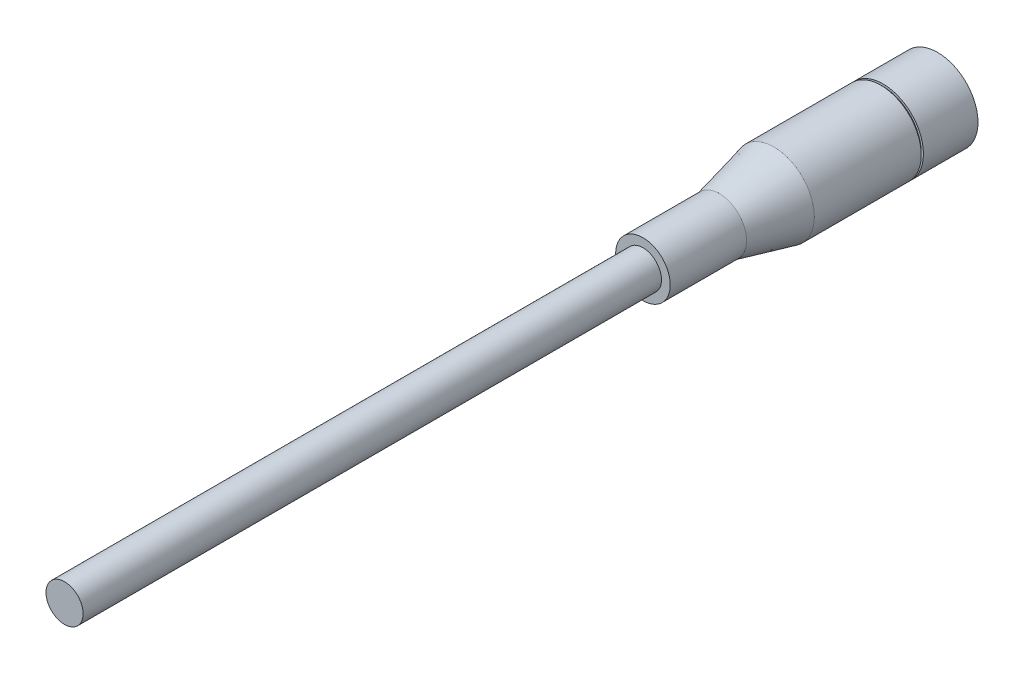
ISO-10303-21;
HEADER;
FILE_DESCRIPTION(('STEP AP214'),'2;1');
FILE_NAME('part.step','',(''),(''),'','','');
FILE_SCHEMA(('AUTOMOTIVE_DESIGN { 1 0 10303 214 1 1 1 1 }'));
ENDSEC;
DATA;
#1=APPLICATION_CONTEXT('core data for automotive mechanical design processes');
#2=APPLICATION_PROTOCOL_DEFINITION('international standard','automotive_design',2000,#1);
#3=PRODUCT_CONTEXT('',#1,'mechanical');
#4=PRODUCT('Part','Part','',(#3));
#5=PRODUCT_RELATED_PRODUCT_CATEGORY('part','',(#4));
#6=PRODUCT_DEFINITION_FORMATION('','',#4);
#7=PRODUCT_DEFINITION_CONTEXT('part definition',#1,'design');
#8=PRODUCT_DEFINITION('design','',#6,#7);
#9=PRODUCT_DEFINITION_SHAPE('','',#8);
#10=(LENGTH_UNIT() NAMED_UNIT(*) SI_UNIT(.MILLI.,.METRE.));
#11=(NAMED_UNIT(*) PLANE_ANGLE_UNIT() SI_UNIT($,.RADIAN.));
#12=(NAMED_UNIT(*) SI_UNIT($,.STERADIAN.) SOLID_ANGLE_UNIT());
#13=UNCERTAINTY_MEASURE_WITH_UNIT(LENGTH_MEASURE(1.E-05),#10,'distance_accuracy_value','');
#14=(GEOMETRIC_REPRESENTATION_CONTEXT(3) GLOBAL_UNCERTAINTY_ASSIGNED_CONTEXT((#13)) GLOBAL_UNIT_ASSIGNED_CONTEXT((#10,
#11,#12)) REPRESENTATION_CONTEXT('',''));
#15=CARTESIAN_POINT('',(0.,0.,0.));
#16=DIRECTION('',(0.,0.,1.));
#17=DIRECTION('',(1.,0.,0.));
#18=AXIS2_PLACEMENT_3D('',#15,#16,#17);
#19=CARTESIAN_POINT('',(0.,0.,0.));
#20=DIRECTION('',(0.,0.,1.));
#21=DIRECTION('',(1.,0.,0.));
#22=AXIS2_PLACEMENT_3D('',#19,#20,#21);
#23=PLANE('',#22);
#24=CARTESIAN_POINT('',(0.,0.,0.));
#25=DIRECTION('',(0.,0.,-1.));
#26=DIRECTION('',(-1.,0.,0.));
#27=AXIS2_PLACEMENT_3D('',#24,#25,#26);
#28=CIRCLE('',#27,3.937);
#29=CARTESIAN_POINT('',(-3.937,0.,0.));
#30=VERTEX_POINT('',#29);
#31=EDGE_CURVE('E84',#30,#30,#28,.T.);
#32=ORIENTED_EDGE('',*,*,#31,.F.);
#33=EDGE_LOOP('',(#32));
#34=FACE_BOUND('',#33,.T.);
#35=CARTESIAN_POINT('',(0.,0.,0.));
#36=DIRECTION('',(0.,0.,1.));
#37=DIRECTION('',(1.,0.,0.));
#38=AXIS2_PLACEMENT_3D('',#35,#36,#37);
#39=CIRCLE('',#38,4.699);
#40=CARTESIAN_POINT('',(4.699,0.,0.));
#41=VERTEX_POINT('',#40);
#42=EDGE_CURVE('E11',#41,#41,#39,.T.);
#43=ORIENTED_EDGE('',*,*,#42,.F.);
#44=EDGE_LOOP('',(#43));
#45=FACE_BOUND('',#44,.T.);
#46=ADVANCED_FACE('F49',(#34,#45),#23,.F.);
#47=CARTESIAN_POINT('',(0.,0.,36.0045));
#48=DIRECTION('',(0.,0.,1.));
#49=DIRECTION('',(1.,0.,0.));
#50=AXIS2_PLACEMENT_3D('',#47,#48,#49);
#51=CYLINDRICAL_SURFACE('',#50,4.699);
#52=CARTESIAN_POINT('',(0.,0.,6.35));
#53=DIRECTION('',(0.,0.,1.));
#54=DIRECTION('',(1.,0.,0.));
#55=AXIS2_PLACEMENT_3D('',#52,#53,#54);
#56=CIRCLE('',#55,4.699);
#57=CARTESIAN_POINT('',(4.699,0.,6.35));
#58=VERTEX_POINT('',#57);
#59=EDGE_CURVE('E56',#58,#58,#56,.T.);
#60=ORIENTED_EDGE('',*,*,#59,.F.);
#61=EDGE_LOOP('',(#60));
#62=FACE_BOUND('',#61,.T.);
#63=ORIENTED_EDGE('',*,*,#42,.T.);
#64=EDGE_LOOP('',(#63));
#65=FACE_BOUND('',#64,.T.);
#66=ADVANCED_FACE('F150',(#62,#65),#51,.T.);
#67=CARTESIAN_POINT('',(0.,4.699,6.35));
#68=DIRECTION('',(0.,0.,-1.));
#69=DIRECTION('',(-1.,0.,0.));
#70=AXIS2_PLACEMENT_3D('',#67,#68,#69);
#71=PLANE('',#70);
#72=CARTESIAN_POINT('',(0.,0.,6.35));
#73=DIRECTION('',(0.,0.,1.));
#74=DIRECTION('',(1.,0.,0.));
#75=AXIS2_PLACEMENT_3D('',#72,#73,#74);
#76=CIRCLE('',#75,4.445);
#77=CARTESIAN_POINT('',(4.445,0.,6.35));
#78=VERTEX_POINT('',#77);
#79=EDGE_CURVE('E60',#78,#78,#76,.T.);
#80=ORIENTED_EDGE('',*,*,#79,.F.);
#81=EDGE_LOOP('',(#80));
#82=FACE_BOUND('',#81,.T.);
#83=ORIENTED_EDGE('',*,*,#59,.T.);
#84=EDGE_LOOP('',(#83));
#85=FACE_BOUND('',#84,.T.);
#86=ADVANCED_FACE('F155',(#82,#85),#71,.F.);
#87=CARTESIAN_POINT('',(0.,0.,36.0045));
#88=DIRECTION('',(0.,0.,1.));
#89=DIRECTION('',(1.,0.,0.));
#90=AXIS2_PLACEMENT_3D('',#87,#88,#89);
#91=CYLINDRICAL_SURFACE('',#90,4.445);
#92=CARTESIAN_POINT('',(0.,0.,6.604));
#93=DIRECTION('',(0.,0.,1.));
#94=DIRECTION('',(1.,0.,0.));
#95=AXIS2_PLACEMENT_3D('',#92,#93,#94);
#96=CIRCLE('',#95,4.445);
#97=CARTESIAN_POINT('',(4.445,0.,6.604));
#98=VERTEX_POINT('',#97);
#99=EDGE_CURVE('E65',#98,#98,#96,.T.);
#100=ORIENTED_EDGE('',*,*,#99,.F.);
#101=EDGE_LOOP('',(#100));
#102=FACE_BOUND('',#101,.T.);
#103=ORIENTED_EDGE('',*,*,#79,.T.);
#104=EDGE_LOOP('',(#103));
#105=FACE_BOUND('',#104,.T.);
#106=ADVANCED_FACE('F163',(#102,#105),#91,.T.);
#107=CARTESIAN_POINT('',(0.,4.445,6.604));
#108=DIRECTION('',(0.,0.,1.));
#109=DIRECTION('',(1.,0.,0.));
#110=AXIS2_PLACEMENT_3D('',#107,#108,#109);
#111=PLANE('',#110);
#112=CARTESIAN_POINT('',(0.,0.,6.604));
#113=DIRECTION('',(0.,0.,1.));
#114=DIRECTION('',(1.,0.,0.));
#115=AXIS2_PLACEMENT_3D('',#112,#113,#114);
#116=CIRCLE('',#115,4.699);
#117=CARTESIAN_POINT('',(4.699,0.,6.604));
#118=VERTEX_POINT('',#117);
#119=EDGE_CURVE('E68',#118,#118,#116,.T.);
#120=ORIENTED_EDGE('',*,*,#119,.F.);
#121=EDGE_LOOP('',(#120));
#122=FACE_BOUND('',#121,.T.);
#123=ORIENTED_EDGE('',*,*,#99,.T.);
#124=EDGE_LOOP('',(#123));
#125=FACE_BOUND('',#124,.T.);
#126=ADVANCED_FACE('F170',(#122,#125),#111,.F.);
#127=CARTESIAN_POINT('',(0.,0.,36.0045));
#128=DIRECTION('',(0.,0.,1.));
#129=DIRECTION('',(1.,0.,0.));
#130=AXIS2_PLACEMENT_3D('',#127,#128,#129);
#131=CYLINDRICAL_SURFACE('',#130,4.699);
#132=CARTESIAN_POINT('',(0.,0.,19.05));
#133=DIRECTION('',(0.,0.,1.));
#134=DIRECTION('',(1.,0.,0.));
#135=AXIS2_PLACEMENT_3D('',#132,#133,#134);
#136=CIRCLE('',#135,4.699);
#137=CARTESIAN_POINT('',(4.699,0.,19.05));
#138=VERTEX_POINT('',#137);
#139=EDGE_CURVE('E71',#138,#138,#136,.T.);
#140=ORIENTED_EDGE('',*,*,#139,.F.);
#141=EDGE_LOOP('',(#140));
#142=FACE_BOUND('',#141,.T.);
#143=ORIENTED_EDGE('',*,*,#119,.T.);
#144=EDGE_LOOP('',(#143));
#145=FACE_BOUND('',#144,.T.);
#146=ADVANCED_FACE('F174',(#142,#145),#131,.T.);
#147=CARTESIAN_POINT('',(0.,0.,19.05));
#148=DIRECTION('',(0.,0.,-1.));
#149=DIRECTION('',(-1.,0.,0.));
#150=AXIS2_PLACEMENT_3D('',#147,#148,#149);
#151=CONICAL_SURFACE('',#150,4.699,0.235544980720863);
#152=CARTESIAN_POINT('',(0.,0.,25.4));
#153=DIRECTION('',(0.,0.,1.));
#154=DIRECTION('',(1.,0.,0.));
#155=AXIS2_PLACEMENT_3D('',#152,#153,#154);
#156=CIRCLE('',#155,3.175);
#157=CARTESIAN_POINT('',(3.175,0.,25.4));
#158=VERTEX_POINT('',#157);
#159=EDGE_CURVE('E74',#158,#158,#156,.T.);
#160=ORIENTED_EDGE('',*,*,#159,.F.);
#161=EDGE_LOOP('',(#160));
#162=FACE_BOUND('',#161,.T.);
#163=ORIENTED_EDGE('',*,*,#139,.T.);
#164=EDGE_LOOP('',(#163));
#165=FACE_BOUND('',#164,.T.);
#166=ADVANCED_FACE('F178',(#162,#165),#151,.T.);
#167=CARTESIAN_POINT('',(0.,0.,36.0045));
#168=DIRECTION('',(0.,0.,1.));
#169=DIRECTION('',(1.,0.,0.));
#170=AXIS2_PLACEMENT_3D('',#167,#168,#169);
#171=CYLINDRICAL_SURFACE('',#170,3.175);
#172=CARTESIAN_POINT('',(0.,0.,34.29));
#173=DIRECTION('',(0.,0.,1.));
#174=DIRECTION('',(1.,0.,0.));
#175=AXIS2_PLACEMENT_3D('',#172,#173,#174);
#176=CIRCLE('',#175,3.175);
#177=CARTESIAN_POINT('',(3.175,0.,34.29));
#178=VERTEX_POINT('',#177);
#179=EDGE_CURVE('E77',#178,#178,#176,.T.);
#180=ORIENTED_EDGE('',*,*,#179,.F.);
#181=EDGE_LOOP('',(#180));
#182=FACE_BOUND('',#181,.T.);
#183=ORIENTED_EDGE('',*,*,#159,.T.);
#184=EDGE_LOOP('',(#183));
#185=FACE_BOUND('',#184,.T.);
#186=ADVANCED_FACE('F182',(#182,#185),#171,.T.);
#187=CARTESIAN_POINT('',(0.,3.175,34.29));
#188=DIRECTION('',(0.,0.,-1.));
#189=DIRECTION('',(-1.,0.,0.));
#190=AXIS2_PLACEMENT_3D('',#187,#188,#189);
#191=PLANE('',#190);
#192=CARTESIAN_POINT('',(0.,0.,34.29));
#193=DIRECTION('',(0.,0.,-1.));
#194=DIRECTION('',(-1.,0.,0.));
#195=AXIS2_PLACEMENT_3D('',#192,#193,#194);
#196=CIRCLE('',#195,2.159);
#197=CARTESIAN_POINT('',(-2.159,0.,34.29));
#198=VERTEX_POINT('',#197);
#199=EDGE_CURVE('E52',#198,#198,#196,.T.);
#200=ORIENTED_EDGE('',*,*,#199,.T.);
#201=EDGE_LOOP('',(#200));
#202=FACE_BOUND('',#201,.T.);
#203=ORIENTED_EDGE('',*,*,#179,.T.);
#204=EDGE_LOOP('',(#203));
#205=FACE_BOUND('',#204,.T.);
#206=ADVANCED_FACE('F186',(#202,#205),#191,.F.);
#207=CARTESIAN_POINT('',(0.,0.,101.6));
#208=DIRECTION('',(0.,0.,-1.));
#209=DIRECTION('',(-1.,0.,0.));
#210=AXIS2_PLACEMENT_3D('',#207,#208,#209);
#211=CYLINDRICAL_SURFACE('',#210,2.159);
#212=CARTESIAN_POINT('',(0.,0.,101.6));
#213=DIRECTION('',(0.,0.,-1.));
#214=DIRECTION('',(-1.,0.,0.));
#215=AXIS2_PLACEMENT_3D('',#212,#213,#214);
#216=CIRCLE('',#215,2.159);
#217=CARTESIAN_POINT('',(-2.159,0.,101.6));
#218=VERTEX_POINT('',#217);
#219=EDGE_CURVE('E80',#218,#218,#216,.T.);
#220=ORIENTED_EDGE('',*,*,#219,.T.);
#221=EDGE_LOOP('',(#220));
#222=FACE_BOUND('',#221,.T.);
#223=ORIENTED_EDGE('',*,*,#199,.F.);
#224=EDGE_LOOP('',(#223));
#225=FACE_BOUND('',#224,.T.);
#226=ADVANCED_FACE('F146',(#222,#225),#211,.T.);
#227=CARTESIAN_POINT('',(0.,0.,101.6));
#228=DIRECTION('',(0.,0.,-1.));
#229=DIRECTION('',(-1.,0.,0.));
#230=AXIS2_PLACEMENT_3D('',#227,#228,#229);
#231=PLANE('',#230);
#232=ORIENTED_EDGE('',*,*,#219,.F.);
#233=EDGE_LOOP('',(#232));
#234=FACE_BOUND('',#233,.T.);
#235=ADVANCED_FACE('F137',(#234),#231,.F.);
#236=CARTESIAN_POINT('',(0.,0.,5.08));
#237=DIRECTION('',(0.,0.,-1.));
#238=DIRECTION('',(-1.,0.,0.));
#239=AXIS2_PLACEMENT_3D('',#236,#237,#238);
#240=CYLINDRICAL_SURFACE('',#239,3.175);
#241=CARTESIAN_POINT('',(0.,0.,5.08));
#242=DIRECTION('',(0.,0.,-1.));
#243=DIRECTION('',(-1.,0.,0.));
#244=AXIS2_PLACEMENT_3D('',#241,#242,#243);
#245=CIRCLE('',#244,3.175);
#246=CARTESIAN_POINT('',(-3.175,0.,5.08));
#247=VERTEX_POINT('',#246);
#248=EDGE_CURVE('E87',#247,#247,#245,.T.);
#249=ORIENTED_EDGE('',*,*,#248,.T.);
#250=EDGE_LOOP('',(#249));
#251=FACE_BOUND('',#250,.T.);
#252=CARTESIAN_POINT('',(0.,0.,0.));
#253=DIRECTION('',(0.,0.,-1.));
#254=DIRECTION('',(-1.,0.,0.));
#255=AXIS2_PLACEMENT_3D('',#252,#253,#254);
#256=CIRCLE('',#255,3.175);
#257=CARTESIAN_POINT('',(-3.175,0.,0.));
#258=VERTEX_POINT('',#257);
#259=EDGE_CURVE('E88',#258,#258,#256,.T.);
#260=ORIENTED_EDGE('',*,*,#259,.F.);
#261=EDGE_LOOP('',(#260));
#262=FACE_BOUND('',#261,.T.);
#263=ADVANCED_FACE('F134',(#251,#262),#240,.T.);
#264=CARTESIAN_POINT('',(0.,0.,5.08));
#265=DIRECTION('',(0.,0.,-1.));
#266=DIRECTION('',(-1.,0.,0.));
#267=AXIS2_PLACEMENT_3D('',#264,#265,#266);
#268=CYLINDRICAL_SURFACE('',#267,3.937);
#269=CARTESIAN_POINT('',(0.,0.,5.08));
#270=DIRECTION('',(0.,0.,-1.));
#271=DIRECTION('',(-1.,0.,0.));
#272=AXIS2_PLACEMENT_3D('',#269,#270,#271);
#273=CIRCLE('',#272,3.937);
#274=CARTESIAN_POINT('',(-3.937,0.,5.08));
#275=VERTEX_POINT('',#274);
#276=EDGE_CURVE('E83',#275,#275,#273,.T.);
#277=ORIENTED_EDGE('',*,*,#276,.F.);
#278=EDGE_LOOP('',(#277));
#279=FACE_BOUND('',#278,.T.);
#280=ORIENTED_EDGE('',*,*,#31,.T.);
#281=EDGE_LOOP('',(#280));
#282=FACE_BOUND('',#281,.T.);
#283=ADVANCED_FACE('F136',(#279,#282),#268,.F.);
#284=CARTESIAN_POINT('',(-10.4792213562373,0.,5.08));
#285=DIRECTION('',(0.,0.,-1.));
#286=DIRECTION('',(-1.,0.,0.));
#287=AXIS2_PLACEMENT_3D('',#284,#285,#286);
#288=PLANE('',#287);
#289=ORIENTED_EDGE('',*,*,#248,.F.);
#290=EDGE_LOOP('',(#289));
#291=FACE_BOUND('',#290,.T.);
#292=ORIENTED_EDGE('',*,*,#276,.T.);
#293=EDGE_LOOP('',(#292));
#294=FACE_BOUND('',#293,.T.);
#295=ADVANCED_FACE('F127',(#291,#294),#288,.T.);
#296=CARTESIAN_POINT('',(-2.54,0.,0.));
#297=DIRECTION('',(0.,0.,-1.));
#298=DIRECTION('',(-1.,0.,0.));
#299=AXIS2_PLACEMENT_3D('',#296,#297,#298);
#300=CIRCLE('',#299,0.381);
#301=CARTESIAN_POINT('',(-2.921,0.,0.));
#302=VERTEX_POINT('',#301);
#303=EDGE_CURVE('E108',#302,#302,#300,.T.);
#304=ORIENTED_EDGE('',*,*,#303,.F.);
#305=EDGE_LOOP('',(#304));
#306=FACE_BOUND('',#305,.T.);
#307=CARTESIAN_POINT('',(0.,2.54,0.));
#308=DIRECTION('',(0.,0.,-1.));
#309=DIRECTION('',(-1.,0.,0.));
#310=AXIS2_PLACEMENT_3D('',#307,#308,#309);
#311=CIRCLE('',#310,0.381);
#312=CARTESIAN_POINT('',(-0.381,2.54,0.));
#313=VERTEX_POINT('',#312);
#314=EDGE_CURVE('E102',#313,#313,#311,.T.);
#315=ORIENTED_EDGE('',*,*,#314,.F.);
#316=EDGE_LOOP('',(#315));
#317=FACE_BOUND('',#316,.T.);
#318=CARTESIAN_POINT('',(2.54,0.,0.));
#319=DIRECTION('',(0.,0.,-1.));
#320=DIRECTION('',(-1.,0.,0.));
#321=AXIS2_PLACEMENT_3D('',#318,#319,#320);
#322=CIRCLE('',#321,0.381);
#323=CARTESIAN_POINT('',(2.159,0.,0.));
#324=VERTEX_POINT('',#323);
#325=EDGE_CURVE('E96',#324,#324,#322,.T.);
#326=ORIENTED_EDGE('',*,*,#325,.F.);
#327=EDGE_LOOP('',(#326));
#328=FACE_BOUND('',#327,.T.);
#329=ORIENTED_EDGE('',*,*,#259,.T.);
#330=EDGE_LOOP('',(#329));
#331=FACE_BOUND('',#330,.T.);
#332=ADVANCED_FACE('F123',(#306,#317,#328,#331),#23,.F.);
#333=CARTESIAN_POINT('',(2.54,0.,5.08));
#334=DIRECTION('',(0.,0.,-1.));
#335=DIRECTION('',(-1.,0.,0.));
#336=AXIS2_PLACEMENT_3D('',#333,#334,#335);
#337=CYLINDRICAL_SURFACE('',#336,0.381);
#338=CARTESIAN_POINT('',(2.54,0.,5.08));
#339=DIRECTION('',(0.,0.,-1.));
#340=DIRECTION('',(-1.,0.,0.));
#341=AXIS2_PLACEMENT_3D('',#338,#339,#340);
#342=CIRCLE('',#341,0.381);
#343=CARTESIAN_POINT('',(2.159,0.,5.08));
#344=VERTEX_POINT('',#343);
#345=EDGE_CURVE('E91',#344,#344,#342,.T.);
#346=ORIENTED_EDGE('',*,*,#345,.F.);
#347=EDGE_LOOP('',(#346));
#348=FACE_BOUND('',#347,.T.);
#349=ORIENTED_EDGE('',*,*,#325,.T.);
#350=EDGE_LOOP('',(#349));
#351=FACE_BOUND('',#350,.T.);
#352=ADVANCED_FACE('F126',(#348,#351),#337,.F.);
#353=CARTESIAN_POINT('',(-10.4792213562373,0.,5.08));
#354=DIRECTION('',(0.,0.,-1.));
#355=DIRECTION('',(-1.,0.,0.));
#356=AXIS2_PLACEMENT_3D('',#353,#354,#355);
#357=PLANE('',#356);
#358=ORIENTED_EDGE('',*,*,#345,.T.);
#359=EDGE_LOOP('',(#358));
#360=FACE_BOUND('',#359,.T.);
#361=ADVANCED_FACE('F257',(#360),#357,.T.);
#362=CARTESIAN_POINT('',(0.,2.54,5.08));
#363=DIRECTION('',(0.,0.,-1.));
#364=DIRECTION('',(-1.,0.,0.));
#365=AXIS2_PLACEMENT_3D('',#362,#363,#364);
#366=CYLINDRICAL_SURFACE('',#365,0.381);
#367=CARTESIAN_POINT('',(0.,2.54,5.08));
#368=DIRECTION('',(0.,0.,-1.));
#369=DIRECTION('',(-1.,0.,0.));
#370=AXIS2_PLACEMENT_3D('',#367,#368,#369);
#371=CIRCLE('',#370,0.381);
#372=CARTESIAN_POINT('',(-0.381,2.54,5.08));
#373=VERTEX_POINT('',#372);
#374=EDGE_CURVE('E99',#373,#373,#371,.T.);
#375=ORIENTED_EDGE('',*,*,#374,.F.);
#376=EDGE_LOOP('',(#375));
#377=FACE_BOUND('',#376,.T.);
#378=ORIENTED_EDGE('',*,*,#314,.T.);
#379=EDGE_LOOP('',(#378));
#380=FACE_BOUND('',#379,.T.);
#381=ADVANCED_FACE('F267',(#377,#380),#366,.F.);
#382=CARTESIAN_POINT('',(-10.4792213562373,0.,5.08));
#383=DIRECTION('',(0.,0.,-1.));
#384=DIRECTION('',(-1.,0.,0.));
#385=AXIS2_PLACEMENT_3D('',#382,#383,#384);
#386=PLANE('',#385);
#387=ORIENTED_EDGE('',*,*,#374,.T.);
#388=EDGE_LOOP('',(#387));
#389=FACE_BOUND('',#388,.T.);
#390=ADVANCED_FACE('F119',(#389),#386,.T.);
#391=CARTESIAN_POINT('',(-2.54,0.,5.08));
#392=DIRECTION('',(0.,0.,-1.));
#393=DIRECTION('',(-1.,0.,0.));
#394=AXIS2_PLACEMENT_3D('',#391,#392,#393);
#395=CYLINDRICAL_SURFACE('',#394,0.381);
#396=CARTESIAN_POINT('',(-2.54,0.,5.08));
#397=DIRECTION('',(0.,0.,-1.));
#398=DIRECTION('',(-1.,0.,0.));
#399=AXIS2_PLACEMENT_3D('',#396,#397,#398);
#400=CIRCLE('',#399,0.381);
#401=CARTESIAN_POINT('',(-2.921,0.,5.08));
#402=VERTEX_POINT('',#401);
#403=EDGE_CURVE('E105',#402,#402,#400,.T.);
#404=ORIENTED_EDGE('',*,*,#403,.F.);
#405=EDGE_LOOP('',(#404));
#406=FACE_BOUND('',#405,.T.);
#407=ORIENTED_EDGE('',*,*,#303,.T.);
#408=EDGE_LOOP('',(#407));
#409=FACE_BOUND('',#408,.T.);
#410=ADVANCED_FACE('F116',(#406,#409),#395,.F.);
#411=CARTESIAN_POINT('',(-10.4792213562373,0.,5.08));
#412=DIRECTION('',(0.,0.,-1.));
#413=DIRECTION('',(-1.,0.,0.));
#414=AXIS2_PLACEMENT_3D('',#411,#412,#413);
#415=PLANE('',#414);
#416=ORIENTED_EDGE('',*,*,#403,.T.);
#417=EDGE_LOOP('',(#416));
#418=FACE_BOUND('',#417,.T.);
#419=ADVANCED_FACE('F114',(#418),#415,.T.);
#420=CLOSED_SHELL('',(#46,#66,#86,#106,#126,#146,#166,#186,#206,#226,#235,#263,#283,#295,#332,
#352,#361,#381,#390,#410,#419));
#421=MANIFOLD_SOLID_BREP('B2',#420);
#422=ADVANCED_BREP_SHAPE_REPRESENTATION('',(#18,#421),#14);
#423=SHAPE_DEFINITION_REPRESENTATION(#9,#422);
ENDSEC;
END-ISO-10303-21;
